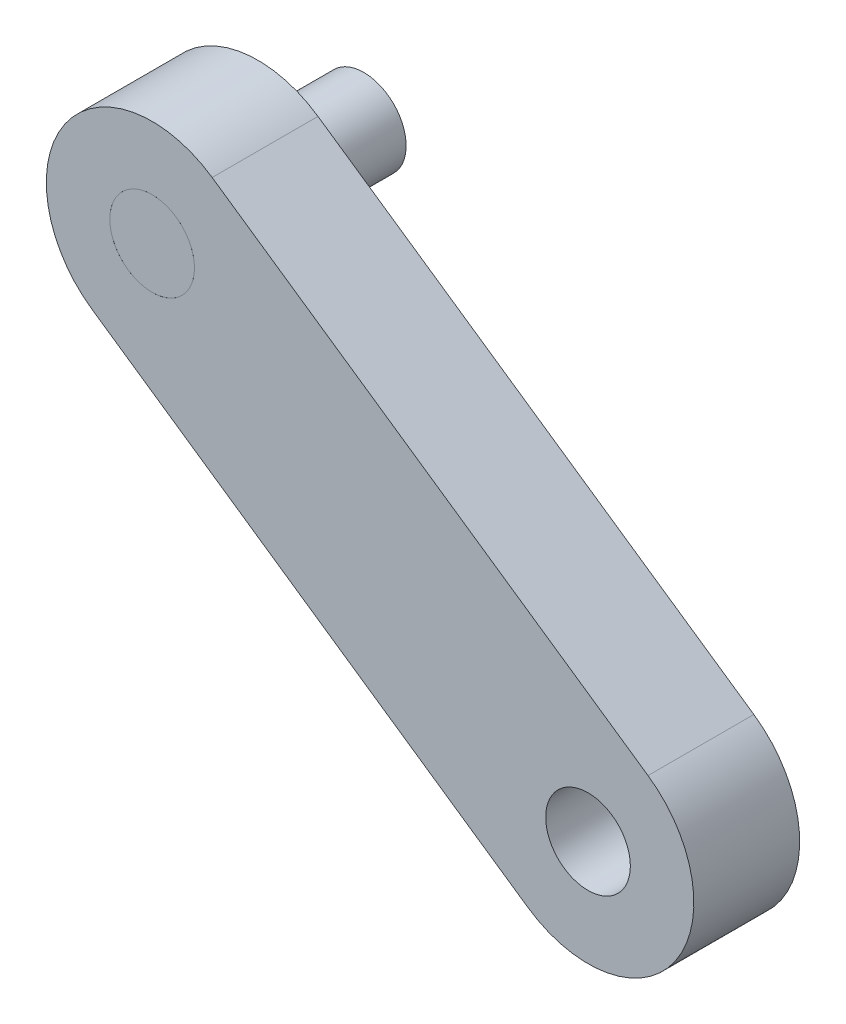
ISO-10303-21;
HEADER;
FILE_DESCRIPTION(('STEP AP214'),'2;1');
FILE_NAME('part.step','',(''),(''),'','','');
FILE_SCHEMA(('AUTOMOTIVE_DESIGN { 1 0 10303 214 1 1 1 1 }'));
ENDSEC;
DATA;
#1=APPLICATION_CONTEXT('core data for automotive mechanical design processes');
#2=APPLICATION_PROTOCOL_DEFINITION('international standard','automotive_design',2000,#1);
#3=PRODUCT_CONTEXT('',#1,'mechanical');
#4=PRODUCT('Part','Part','',(#3));
#5=PRODUCT_RELATED_PRODUCT_CATEGORY('part','',(#4));
#6=PRODUCT_DEFINITION_FORMATION('','',#4);
#7=PRODUCT_DEFINITION_CONTEXT('part definition',#1,'design');
#8=PRODUCT_DEFINITION('design','',#6,#7);
#9=PRODUCT_DEFINITION_SHAPE('','',#8);
#10=(LENGTH_UNIT() NAMED_UNIT(*) SI_UNIT(.MILLI.,.METRE.));
#11=(NAMED_UNIT(*) PLANE_ANGLE_UNIT() SI_UNIT($,.RADIAN.));
#12=(NAMED_UNIT(*) SI_UNIT($,.STERADIAN.) SOLID_ANGLE_UNIT());
#13=UNCERTAINTY_MEASURE_WITH_UNIT(LENGTH_MEASURE(1.E-05),#10,'distance_accuracy_value','');
#14=(GEOMETRIC_REPRESENTATION_CONTEXT(3) GLOBAL_UNCERTAINTY_ASSIGNED_CONTEXT((#13)) GLOBAL_UNIT_ASSIGNED_CONTEXT((#10,
#11,#12)) REPRESENTATION_CONTEXT('',''));
#15=CARTESIAN_POINT('',(0.,0.,0.));
#16=DIRECTION('',(0.,0.,1.));
#17=DIRECTION('',(1.,0.,0.));
#18=AXIS2_PLACEMENT_3D('',#15,#16,#17);
#19=CARTESIAN_POINT('',(-44.3801418640162,84.6953489238267,-10.));
#20=DIRECTION('',(0.,0.,1.));
#21=DIRECTION('',(-1.,0.,0.));
#22=AXIS2_PLACEMENT_3D('',#19,#20,#21);
#23=CYLINDRICAL_SURFACE('',#22,2.);
#24=CARTESIAN_POINT('',(-44.3801418640162,84.6953489238267,-10.));
#25=DIRECTION('',(0.,0.,-1.));
#26=DIRECTION('',(-1.,0.,0.));
#27=AXIS2_PLACEMENT_3D('',#24,#25,#26);
#28=CIRCLE('',#27,2.);
#29=CARTESIAN_POINT('',(-46.3801418640162,84.6953489238267,-10.));
#30=VERTEX_POINT('',#29);
#31=EDGE_CURVE('E11',#30,#30,#28,.T.);
#32=ORIENTED_EDGE('',*,*,#31,.F.);
#33=EDGE_LOOP('',(#32));
#34=FACE_BOUND('',#33,.T.);
#35=CARTESIAN_POINT('',(-44.3801418640162,84.6953489238267,0.));
#36=DIRECTION('',(0.,0.,-1.));
#37=DIRECTION('',(-1.,0.,0.));
#38=AXIS2_PLACEMENT_3D('',#35,#36,#37);
#39=CIRCLE('',#38,2.);
#40=CARTESIAN_POINT('',(-46.3801418640162,84.6953489238267,0.));
#41=VERTEX_POINT('',#40);
#42=EDGE_CURVE('E50',#41,#41,#39,.T.);
#43=ORIENTED_EDGE('',*,*,#42,.T.);
#44=EDGE_LOOP('',(#43));
#45=FACE_BOUND('',#44,.T.);
#46=ADVANCED_FACE('F47',(#34,#45),#23,.T.);
#47=CARTESIAN_POINT('',(-44.3801418640162,84.6953489238267,-10.));
#48=DIRECTION('',(0.,0.,1.));
#49=DIRECTION('',(-1.,0.,0.));
#50=AXIS2_PLACEMENT_3D('',#47,#48,#49);
#51=PLANE('',#50);
#52=ORIENTED_EDGE('',*,*,#31,.T.);
#53=EDGE_LOOP('',(#52));
#54=FACE_BOUND('',#53,.T.);
#55=ADVANCED_FACE('F62',(#54),#51,.F.);
#56=CARTESIAN_POINT('',(-44.3801418640162,84.6953489238267,0.));
#57=DIRECTION('',(0.,0.,1.));
#58=DIRECTION('',(-1.,0.,0.));
#59=AXIS2_PLACEMENT_3D('',#56,#57,#58);
#60=PLANE('',#59);
#61=ORIENTED_EDGE('',*,*,#42,.F.);
#62=EDGE_LOOP('',(#61));
#63=FACE_BOUND('',#62,.T.);
#64=ADVANCED_FACE('F60',(#63),#60,.T.);
#65=CLOSED_SHELL('',(#46,#55,#64));
#66=MANIFOLD_SOLID_BREP('B2',#65);
#67=CARTESIAN_POINT('',(22.4546862512256,32.6242146663216,-5.));
#68=DIRECTION('',(0.566966615087807,0.823740770737903,0.));
#69=DIRECTION('',(-0.823740770737903,0.566966615087807,0.));
#70=AXIS2_PLACEMENT_3D('',#67,#68,#69);
#71=PLANE('',#70);
#72=DIRECTION('',(0.823740770737903,-0.566966615087807,0.));
#73=VECTOR('',#72,1.);
#74=CARTESIAN_POINT('',(22.4546862512256,32.6242146663216,0.));
#75=LINE('',#74,#73);
#76=CARTESIAN_POINT('',(-47.2149749394553,80.5766450701372,0.));
#77=VERTEX_POINT('',#76);
#78=CARTESIAN_POINT('',(-26.6214556710077,66.402479692942,0.));
#79=VERTEX_POINT('',#78);
#80=EDGE_CURVE('E160',#77,#79,#75,.T.);
#81=ORIENTED_EDGE('',*,*,#80,.F.);
#82=DIRECTION('',(0.,0.,1.));
#83=VECTOR('',#82,1.);
#84=CARTESIAN_POINT('',(-47.2149749394553,80.5766450701372,-5.));
#85=LINE('',#84,#83);
#86=CARTESIAN_POINT('',(-47.2149749394553,80.5766450701372,-5.));
#87=VERTEX_POINT('',#86);
#88=EDGE_CURVE('E153',#87,#77,#85,.T.);
#89=ORIENTED_EDGE('',*,*,#88,.F.);
#90=DIRECTION('',(0.823740770737903,-0.566966615087807,0.));
#91=VECTOR('',#90,1.);
#92=CARTESIAN_POINT('',(22.4546862512256,32.6242146663216,-5.));
#93=LINE('',#92,#91);
#94=CARTESIAN_POINT('',(-26.6214556710077,66.402479692942,-5.));
#95=VERTEX_POINT('',#94);
#96=EDGE_CURVE('E146',#87,#95,#93,.T.);
#97=ORIENTED_EDGE('',*,*,#96,.T.);
#98=DIRECTION('',(0.,0.,1.));
#99=VECTOR('',#98,1.);
#100=CARTESIAN_POINT('',(-26.6214556710077,66.402479692942,-5.));
#101=LINE('',#100,#99);
#102=EDGE_CURVE('E45',#95,#79,#101,.T.);
#103=ORIENTED_EDGE('',*,*,#102,.T.);
#104=EDGE_LOOP('',(#81,#89,#97,#103));
#105=FACE_BOUND('',#104,.T.);
#106=ADVANCED_FACE('F88',(#105),#71,.F.);
#107=CARTESIAN_POINT('',(-23.7866225955687,70.5211835466315,-5.));
#108=DIRECTION('',(0.,0.,1.));
#109=DIRECTION('',(-1.,0.,0.));
#110=AXIS2_PLACEMENT_3D('',#107,#108,#109);
#111=CYLINDRICAL_SURFACE('',#110,4.99999999999997);
#112=CARTESIAN_POINT('',(-23.7866225955687,70.5211835466315,0.));
#113=DIRECTION('',(0.,0.,1.));
#114=DIRECTION('',(1.,0.,0.));
#115=AXIS2_PLACEMENT_3D('',#112,#113,#114);
#116=CIRCLE('',#115,4.99999999999997);
#117=CARTESIAN_POINT('',(-20.9517895201297,74.639887400321,0.));
#118=VERTEX_POINT('',#117);
#119=EDGE_CURVE('E162',#79,#118,#116,.T.);
#120=ORIENTED_EDGE('',*,*,#119,.F.);
#121=ORIENTED_EDGE('',*,*,#102,.F.);
#122=CARTESIAN_POINT('',(-23.7866225955687,70.5211835466315,-5.));
#123=DIRECTION('',(0.,0.,1.));
#124=DIRECTION('',(1.,0.,0.));
#125=AXIS2_PLACEMENT_3D('',#122,#123,#124);
#126=CIRCLE('',#125,4.99999999999997);
#127=CARTESIAN_POINT('',(-20.9517895201297,74.639887400321,-5.));
#128=VERTEX_POINT('',#127);
#129=EDGE_CURVE('E130',#95,#128,#126,.T.);
#130=ORIENTED_EDGE('',*,*,#129,.T.);
#131=DIRECTION('',(0.,0.,1.));
#132=VECTOR('',#131,1.);
#133=CARTESIAN_POINT('',(-20.9517895201297,74.639887400321,-5.));
#134=LINE('',#133,#132);
#135=EDGE_CURVE('E97',#128,#118,#134,.T.);
#136=ORIENTED_EDGE('',*,*,#135,.T.);
#137=EDGE_LOOP('',(#120,#121,#130,#136));
#138=FACE_BOUND('',#137,.T.);
#139=ADVANCED_FACE('F144',(#138),#111,.T.);
#140=CARTESIAN_POINT('',(28.1243524021036,40.8616223737004,-5.));
#141=DIRECTION('',(0.56696661508781,0.823740770737901,0.));
#142=DIRECTION('',(-0.823740770737901,0.56696661508781,0.));
#143=AXIS2_PLACEMENT_3D('',#140,#141,#142);
#144=PLANE('',#143);
#145=DIRECTION('',(0.823740770737901,-0.56696661508781,0.));
#146=VECTOR('',#145,1.);
#147=CARTESIAN_POINT('',(28.1243524021036,40.8616223737004,0.));
#148=LINE('',#147,#146);
#149=CARTESIAN_POINT('',(-41.5453087885772,88.8140527775162,0.));
#150=VERTEX_POINT('',#149);
#151=EDGE_CURVE('E140',#150,#118,#148,.T.);
#152=ORIENTED_EDGE('',*,*,#151,.T.);
#153=ORIENTED_EDGE('',*,*,#135,.F.);
#154=DIRECTION('',(0.823740770737901,-0.56696661508781,0.));
#155=VECTOR('',#154,1.);
#156=CARTESIAN_POINT('',(28.1243524021036,40.8616223737004,-5.));
#157=LINE('',#156,#155);
#158=CARTESIAN_POINT('',(-41.5453087885772,88.8140527775162,-5.));
#159=VERTEX_POINT('',#158);
#160=EDGE_CURVE('E133',#159,#128,#157,.T.);
#161=ORIENTED_EDGE('',*,*,#160,.F.);
#162=DIRECTION('',(0.,0.,1.));
#163=VECTOR('',#162,1.);
#164=CARTESIAN_POINT('',(-41.5453087885772,88.8140527775162,-5.));
#165=LINE('',#164,#163);
#166=EDGE_CURVE('E143',#159,#150,#165,.T.);
#167=ORIENTED_EDGE('',*,*,#166,.T.);
#168=EDGE_LOOP('',(#152,#153,#161,#167));
#169=FACE_BOUND('',#168,.T.);
#170=ADVANCED_FACE('F139',(#169),#144,.T.);
#171=CARTESIAN_POINT('',(-44.3801418640162,84.6953489238267,-5.));
#172=DIRECTION('',(0.,0.,1.));
#173=DIRECTION('',(-1.,0.,0.));
#174=AXIS2_PLACEMENT_3D('',#171,#172,#173);
#175=CYLINDRICAL_SURFACE('',#174,2.);
#176=CARTESIAN_POINT('',(-44.3801418640162,84.6953489238267,-5.));
#177=DIRECTION('',(0.,0.,1.));
#178=DIRECTION('',(1.,0.,0.));
#179=AXIS2_PLACEMENT_3D('',#176,#177,#178);
#180=CIRCLE('',#179,2.);
#181=CARTESIAN_POINT('',(-42.3801418640162,84.6953489238267,-5.));
#182=VERTEX_POINT('',#181);
#183=EDGE_CURVE('E148',#182,#182,#180,.T.);
#184=ORIENTED_EDGE('',*,*,#183,.F.);
#185=EDGE_LOOP('',(#184));
#186=FACE_BOUND('',#185,.T.);
#187=CARTESIAN_POINT('',(-44.3801418640162,84.6953489238267,0.));
#188=DIRECTION('',(0.,0.,1.));
#189=DIRECTION('',(1.,0.,0.));
#190=AXIS2_PLACEMENT_3D('',#187,#188,#189);
#191=CIRCLE('',#190,2.);
#192=CARTESIAN_POINT('',(-42.3801418640162,84.6953489238267,0.));
#193=VERTEX_POINT('',#192);
#194=EDGE_CURVE('E157',#193,#193,#191,.T.);
#195=ORIENTED_EDGE('',*,*,#194,.T.);
#196=EDGE_LOOP('',(#195));
#197=FACE_BOUND('',#196,.T.);
#198=ADVANCED_FACE('F181',(#186,#197),#175,.F.);
#199=CARTESIAN_POINT('',(-23.7866225955687,70.5211835466315,-5.));
#200=DIRECTION('',(0.,0.,1.));
#201=DIRECTION('',(-1.,0.,0.));
#202=AXIS2_PLACEMENT_3D('',#199,#200,#201);
#203=CYLINDRICAL_SURFACE('',#202,2.00000000000001);
#204=CARTESIAN_POINT('',(-23.7866225955687,70.5211835466315,-5.));
#205=DIRECTION('',(0.,0.,1.));
#206=DIRECTION('',(1.,0.,0.));
#207=AXIS2_PLACEMENT_3D('',#204,#205,#206);
#208=CIRCLE('',#207,2.00000000000001);
#209=CARTESIAN_POINT('',(-21.7866225955687,70.5211835466315,-5.));
#210=VERTEX_POINT('',#209);
#211=EDGE_CURVE('E166',#210,#210,#208,.T.);
#212=ORIENTED_EDGE('',*,*,#211,.F.);
#213=EDGE_LOOP('',(#212));
#214=FACE_BOUND('',#213,.T.);
#215=CARTESIAN_POINT('',(-23.7866225955687,70.5211835466315,0.));
#216=DIRECTION('',(0.,0.,1.));
#217=DIRECTION('',(1.,0.,0.));
#218=AXIS2_PLACEMENT_3D('',#215,#216,#217);
#219=CIRCLE('',#218,2.00000000000001);
#220=CARTESIAN_POINT('',(-21.7866225955687,70.5211835466315,0.));
#221=VERTEX_POINT('',#220);
#222=EDGE_CURVE('E154',#221,#221,#219,.T.);
#223=ORIENTED_EDGE('',*,*,#222,.T.);
#224=EDGE_LOOP('',(#223));
#225=FACE_BOUND('',#224,.T.);
#226=ADVANCED_FACE('F90',(#214,#225),#203,.F.);
#227=CARTESIAN_POINT('',(-44.3801418640162,84.6953489238267,-5.));
#228=DIRECTION('',(0.,0.,1.));
#229=DIRECTION('',(-1.,0.,0.));
#230=AXIS2_PLACEMENT_3D('',#227,#228,#229);
#231=CYLINDRICAL_SURFACE('',#230,5.);
#232=CARTESIAN_POINT('',(-44.3801418640162,84.6953489238267,0.));
#233=DIRECTION('',(0.,0.,1.));
#234=DIRECTION('',(1.,0.,0.));
#235=AXIS2_PLACEMENT_3D('',#232,#233,#234);
#236=CIRCLE('',#235,5.);
#237=EDGE_CURVE('E119',#150,#77,#236,.T.);
#238=ORIENTED_EDGE('',*,*,#237,.F.);
#239=ORIENTED_EDGE('',*,*,#166,.F.);
#240=CARTESIAN_POINT('',(-44.3801418640162,84.6953489238267,-5.));
#241=DIRECTION('',(0.,0.,1.));
#242=DIRECTION('',(1.,0.,0.));
#243=AXIS2_PLACEMENT_3D('',#240,#241,#242);
#244=CIRCLE('',#243,5.);
#245=EDGE_CURVE('E105',#159,#87,#244,.T.);
#246=ORIENTED_EDGE('',*,*,#245,.T.);
#247=ORIENTED_EDGE('',*,*,#88,.T.);
#248=EDGE_LOOP('',(#238,#239,#246,#247));
#249=FACE_BOUND('',#248,.T.);
#250=ADVANCED_FACE('F172',(#249),#231,.T.);
#251=CARTESIAN_POINT('',(0.,0.,-5.));
#252=DIRECTION('',(0.,0.,-1.));
#253=DIRECTION('',(1.,0.,0.));
#254=AXIS2_PLACEMENT_3D('',#251,#252,#253);
#255=PLANE('',#254);
#256=ORIENTED_EDGE('',*,*,#211,.T.);
#257=EDGE_LOOP('',(#256));
#258=FACE_BOUND('',#257,.T.);
#259=ORIENTED_EDGE('',*,*,#183,.T.);
#260=EDGE_LOOP('',(#259));
#261=FACE_BOUND('',#260,.T.);
#262=ORIENTED_EDGE('',*,*,#96,.F.);
#263=ORIENTED_EDGE('',*,*,#245,.F.);
#264=ORIENTED_EDGE('',*,*,#160,.T.);
#265=ORIENTED_EDGE('',*,*,#129,.F.);
#266=EDGE_LOOP('',(#262,#263,#264,#265));
#267=FACE_BOUND('',#266,.T.);
#268=ADVANCED_FACE('F135',(#258,#261,#267),#255,.T.);
#269=CARTESIAN_POINT('',(0.,0.,0.));
#270=DIRECTION('',(0.,0.,-1.));
#271=DIRECTION('',(1.,0.,0.));
#272=AXIS2_PLACEMENT_3D('',#269,#270,#271);
#273=PLANE('',#272);
#274=ORIENTED_EDGE('',*,*,#222,.F.);
#275=EDGE_LOOP('',(#274));
#276=FACE_BOUND('',#275,.T.);
#277=ORIENTED_EDGE('',*,*,#194,.F.);
#278=EDGE_LOOP('',(#277));
#279=FACE_BOUND('',#278,.T.);
#280=ORIENTED_EDGE('',*,*,#80,.T.);
#281=ORIENTED_EDGE('',*,*,#119,.T.);
#282=ORIENTED_EDGE('',*,*,#151,.F.);
#283=ORIENTED_EDGE('',*,*,#237,.T.);
#284=EDGE_LOOP('',(#280,#281,#282,#283));
#285=FACE_BOUND('',#284,.T.);
#286=ADVANCED_FACE('F168',(#276,#279,#285),#273,.F.);
#287=CLOSED_SHELL('',(#106,#139,#170,#198,#226,#250,#268,#286));
#288=MANIFOLD_SOLID_BREP('B6',#287);
#289=ADVANCED_BREP_SHAPE_REPRESENTATION('',(#18,#66,#288),#14);
#290=SHAPE_DEFINITION_REPRESENTATION(#9,#289);
ENDSEC;
END-ISO-10303-21;
